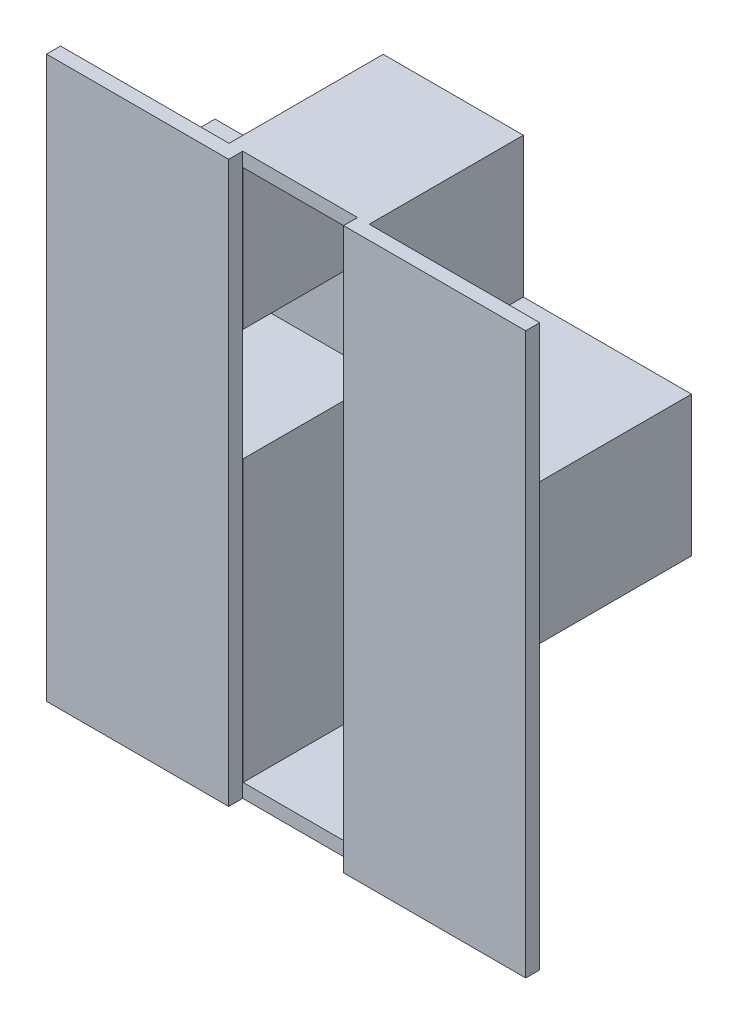
ISO-10303-21;
HEADER;
FILE_DESCRIPTION(('STEP AP214'),'2;1');
FILE_NAME('part.step','',(''),(''),'','','');
FILE_SCHEMA(('AUTOMOTIVE_DESIGN { 1 0 10303 214 1 1 1 1 }'));
ENDSEC;
DATA;
#1=APPLICATION_CONTEXT('core data for automotive mechanical design processes');
#2=APPLICATION_PROTOCOL_DEFINITION('international standard','automotive_design',2000,#1);
#3=PRODUCT_CONTEXT('',#1,'mechanical');
#4=PRODUCT('Part','Part','',(#3));
#5=PRODUCT_RELATED_PRODUCT_CATEGORY('part','',(#4));
#6=PRODUCT_DEFINITION_FORMATION('','',#4);
#7=PRODUCT_DEFINITION_CONTEXT('part definition',#1,'design');
#8=PRODUCT_DEFINITION('design','',#6,#7);
#9=PRODUCT_DEFINITION_SHAPE('','',#8);
#10=(LENGTH_UNIT() NAMED_UNIT(*) SI_UNIT(.MILLI.,.METRE.));
#11=(NAMED_UNIT(*) PLANE_ANGLE_UNIT() SI_UNIT($,.RADIAN.));
#12=(NAMED_UNIT(*) SI_UNIT($,.STERADIAN.) SOLID_ANGLE_UNIT());
#13=UNCERTAINTY_MEASURE_WITH_UNIT(LENGTH_MEASURE(1.E-05),#10,'distance_accuracy_value','');
#14=(GEOMETRIC_REPRESENTATION_CONTEXT(3) GLOBAL_UNCERTAINTY_ASSIGNED_CONTEXT((#13)) GLOBAL_UNIT_ASSIGNED_CONTEXT((#10,
#11,#12)) REPRESENTATION_CONTEXT('',''));
#15=CARTESIAN_POINT('',(0.,0.,0.));
#16=DIRECTION('',(0.,0.,1.));
#17=DIRECTION('',(1.,0.,0.));
#18=AXIS2_PLACEMENT_3D('',#15,#16,#17);
#19=CARTESIAN_POINT('',(0.,0.,55.));
#20=DIRECTION('',(0.,0.,-1.));
#21=DIRECTION('',(-1.,0.,0.));
#22=AXIS2_PLACEMENT_3D('',#19,#20,#21);
#23=PLANE('',#22);
#24=DIRECTION('',(0.,-1.,0.));
#25=VECTOR('',#24,1.);
#26=CARTESIAN_POINT('',(-4.14911528752093,200.,55.));
#27=LINE('',#26,#25);
#28=CARTESIAN_POINT('',(-4.14911528752093,200.,55.));
#29=VERTEX_POINT('',#28);
#30=CARTESIAN_POINT('',(-4.14911528752093,145.,55.));
#31=VERTEX_POINT('',#30);
#32=EDGE_CURVE('E51',#29,#31,#27,.T.);
#33=ORIENTED_EDGE('',*,*,#32,.F.);
#34=DIRECTION('',(-1.,0.,0.));
#35=VECTOR('',#34,1.);
#36=CARTESIAN_POINT('',(0.,200.,55.));
#37=LINE('',#36,#35);
#38=CARTESIAN_POINT('',(-45.1360003244453,200.,55.));
#39=VERTEX_POINT('',#38);
#40=EDGE_CURVE('E37',#29,#39,#37,.T.);
#41=ORIENTED_EDGE('',*,*,#40,.T.);
#42=DIRECTION('',(0.,1.,0.));
#43=VECTOR('',#42,1.);
#44=CARTESIAN_POINT('',(-45.1360003244453,0.,55.));
#45=LINE('',#44,#43);
#46=CARTESIAN_POINT('',(-45.1360003244453,145.,55.));
#47=VERTEX_POINT('',#46);
#48=EDGE_CURVE('E11',#47,#39,#45,.T.);
#49=ORIENTED_EDGE('',*,*,#48,.F.);
#50=DIRECTION('',(-1.,0.,0.));
#51=VECTOR('',#50,1.);
#52=CARTESIAN_POINT('',(-45.,145.,55.));
#53=LINE('',#52,#51);
#54=CARTESIAN_POINT('',(-45.,145.,55.));
#55=VERTEX_POINT('',#54);
#56=EDGE_CURVE('E314',#55,#47,#53,.T.);
#57=ORIENTED_EDGE('',*,*,#56,.F.);
#58=DIRECTION('',(0.,-1.,0.));
#59=VECTOR('',#58,1.);
#60=CARTESIAN_POINT('',(-45.,195.,55.));
#61=LINE('',#60,#59);
#62=CARTESIAN_POINT('',(-45.,195.,55.));
#63=VERTEX_POINT('',#62);
#64=EDGE_CURVE('E922',#63,#55,#61,.T.);
#65=ORIENTED_EDGE('',*,*,#64,.F.);
#66=DIRECTION('',(-1.,0.,0.));
#67=VECTOR('',#66,1.);
#68=CARTESIAN_POINT('',(-4.99999999999997,195.,55.));
#69=LINE('',#68,#67);
#70=CARTESIAN_POINT('',(-4.99999999999997,195.,55.));
#71=VERTEX_POINT('',#70);
#72=EDGE_CURVE('E919',#71,#63,#69,.T.);
#73=ORIENTED_EDGE('',*,*,#72,.F.);
#74=DIRECTION('',(0.,1.,0.));
#75=VECTOR('',#74,1.);
#76=CARTESIAN_POINT('',(-4.99999999999997,145.,55.));
#77=LINE('',#76,#75);
#78=CARTESIAN_POINT('',(-4.99999999999997,145.,55.));
#79=VERTEX_POINT('',#78);
#80=EDGE_CURVE('E917',#79,#71,#77,.T.);
#81=ORIENTED_EDGE('',*,*,#80,.F.);
#82=DIRECTION('',(-1.,0.,0.));
#83=VECTOR('',#82,1.);
#84=CARTESIAN_POINT('',(55.,145.,55.));
#85=LINE('',#84,#83);
#86=EDGE_CURVE('E908',#31,#79,#85,.T.);
#87=ORIENTED_EDGE('',*,*,#86,.F.);
#88=EDGE_LOOP('',(#33,#41,#49,#57,#65,#73,#81,#87));
#89=FACE_BOUND('',#88,.T.);
#90=ADVANCED_FACE('F33',(#89),#23,.F.);
#91=CARTESIAN_POINT('',(-4.14911528752092,105.,55.));
#92=VERTEX_POINT('',#91);
#93=CARTESIAN_POINT('',(-4.1491152875209,0.,55.));
#94=VERTEX_POINT('',#93);
#95=EDGE_CURVE('E281',#92,#94,#27,.T.);
#96=ORIENTED_EDGE('',*,*,#95,.F.);
#97=DIRECTION('',(1.,0.,0.));
#98=VECTOR('',#97,1.);
#99=CARTESIAN_POINT('',(-5.,105.,55.));
#100=LINE('',#99,#98);
#101=CARTESIAN_POINT('',(-5.,105.,55.));
#102=VERTEX_POINT('',#101);
#103=EDGE_CURVE('E901',#102,#92,#100,.T.);
#104=ORIENTED_EDGE('',*,*,#103,.F.);
#105=DIRECTION('',(0.,1.,0.));
#106=VECTOR('',#105,1.);
#107=CARTESIAN_POINT('',(-5.,4.99999999999999,55.));
#108=LINE('',#107,#106);
#109=CARTESIAN_POINT('',(-5.,4.99999999999999,55.));
#110=VERTEX_POINT('',#109);
#111=EDGE_CURVE('E906',#110,#102,#108,.T.);
#112=ORIENTED_EDGE('',*,*,#111,.F.);
#113=DIRECTION('',(1.,0.,0.));
#114=VECTOR('',#113,1.);
#115=CARTESIAN_POINT('',(-45.,4.99999999999999,55.));
#116=LINE('',#115,#114);
#117=CARTESIAN_POINT('',(-45.,4.99999999999999,55.));
#118=VERTEX_POINT('',#117);
#119=EDGE_CURVE('E910',#118,#110,#116,.T.);
#120=ORIENTED_EDGE('',*,*,#119,.F.);
#121=DIRECTION('',(0.,-1.,0.));
#122=VECTOR('',#121,1.);
#123=CARTESIAN_POINT('',(-45.,105.,55.));
#124=LINE('',#123,#122);
#125=CARTESIAN_POINT('',(-45.,105.,55.));
#126=VERTEX_POINT('',#125);
#127=EDGE_CURVE('E985',#126,#118,#124,.T.);
#128=ORIENTED_EDGE('',*,*,#127,.F.);
#129=DIRECTION('',(1.,0.,0.));
#130=VECTOR('',#129,1.);
#131=CARTESIAN_POINT('',(-105.,105.,55.));
#132=LINE('',#131,#130);
#133=CARTESIAN_POINT('',(-45.1360003244453,105.,55.));
#134=VERTEX_POINT('',#133);
#135=EDGE_CURVE('E59',#134,#126,#132,.T.);
#136=ORIENTED_EDGE('',*,*,#135,.F.);
#137=CARTESIAN_POINT('',(-45.1360003244453,0.,55.));
#138=VERTEX_POINT('',#137);
#139=EDGE_CURVE('E295',#138,#134,#45,.T.);
#140=ORIENTED_EDGE('',*,*,#139,.F.);
#141=DIRECTION('',(1.,0.,0.));
#142=VECTOR('',#141,1.);
#143=CARTESIAN_POINT('',(-50.,0.,55.));
#144=LINE('',#143,#142);
#145=EDGE_CURVE('E347',#138,#94,#144,.T.);
#146=ORIENTED_EDGE('',*,*,#145,.T.);
#147=EDGE_LOOP('',(#96,#104,#112,#120,#128,#136,#140,#146));
#148=FACE_BOUND('',#147,.T.);
#149=ADVANCED_FACE('F514',(#148),#23,.F.);
#150=CARTESIAN_POINT('',(0.,0.,5.));
#151=DIRECTION('',(-1.,0.,0.));
#152=DIRECTION('',(0.,0.,1.));
#153=AXIS2_PLACEMENT_3D('',#150,#151,#152);
#154=PLANE('',#153);
#155=DIRECTION('',(0.,1.,0.));
#156=VECTOR('',#155,1.);
#157=CARTESIAN_POINT('',(0.,0.,0.));
#158=LINE('',#157,#156);
#159=CARTESIAN_POINT('',(0.,0.,0.));
#160=VERTEX_POINT('',#159);
#161=CARTESIAN_POINT('',(0.,100.,0.));
#162=VERTEX_POINT('',#161);
#163=EDGE_CURVE('E409',#160,#162,#158,.T.);
#164=ORIENTED_EDGE('',*,*,#163,.T.);
#165=DIRECTION('',(0.,0.,-1.));
#166=VECTOR('',#165,1.);
#167=CARTESIAN_POINT('',(0.,100.,5.));
#168=LINE('',#167,#166);
#169=CARTESIAN_POINT('',(0.,100.,55.));
#170=VERTEX_POINT('',#169);
#171=EDGE_CURVE('E43',#170,#162,#168,.T.);
#172=ORIENTED_EDGE('',*,*,#171,.F.);
#173=DIRECTION('',(0.,1.,0.));
#174=VECTOR('',#173,1.);
#175=CARTESIAN_POINT('',(0.,0.,55.));
#176=LINE('',#175,#174);
#177=CARTESIAN_POINT('',(0.,0.,55.));
#178=VERTEX_POINT('',#177);
#179=EDGE_CURVE('E357',#178,#170,#176,.T.);
#180=ORIENTED_EDGE('',*,*,#179,.F.);
#181=DIRECTION('',(0.,0.,-1.));
#182=VECTOR('',#181,1.);
#183=CARTESIAN_POINT('',(0.,0.,5.));
#184=LINE('',#183,#182);
#185=EDGE_CURVE('E340',#178,#160,#184,.T.);
#186=ORIENTED_EDGE('',*,*,#185,.T.);
#187=EDGE_LOOP('',(#164,#172,#180,#186));
#188=FACE_BOUND('',#187,.T.);
#189=ADVANCED_FACE('F35',(#188),#154,.F.);
#190=CARTESIAN_POINT('',(60.,100.,5.));
#191=DIRECTION('',(0.,1.,0.));
#192=DIRECTION('',(-1.,0.,0.));
#193=AXIS2_PLACEMENT_3D('',#190,#191,#192);
#194=PLANE('',#193);
#195=DIRECTION('',(1.,0.,0.));
#196=VECTOR('',#195,1.);
#197=CARTESIAN_POINT('',(60.,100.,0.));
#198=LINE('',#197,#196);
#199=CARTESIAN_POINT('',(60.,100.,0.));
#200=VERTEX_POINT('',#199);
#201=EDGE_CURVE('E407',#162,#200,#198,.T.);
#202=ORIENTED_EDGE('',*,*,#201,.T.);
#203=DIRECTION('',(0.,0.,-1.));
#204=VECTOR('',#203,1.);
#205=CARTESIAN_POINT('',(60.,100.,5.));
#206=LINE('',#205,#204);
#207=CARTESIAN_POINT('',(60.,100.,55.));
#208=VERTEX_POINT('',#207);
#209=EDGE_CURVE('E362',#208,#200,#206,.T.);
#210=ORIENTED_EDGE('',*,*,#209,.F.);
#211=DIRECTION('',(1.,0.,0.));
#212=VECTOR('',#211,1.);
#213=CARTESIAN_POINT('',(0.,100.,55.));
#214=LINE('',#213,#212);
#215=EDGE_CURVE('E418',#170,#208,#214,.T.);
#216=ORIENTED_EDGE('',*,*,#215,.F.);
#217=ORIENTED_EDGE('',*,*,#171,.T.);
#218=EDGE_LOOP('',(#202,#210,#216,#217));
#219=FACE_BOUND('',#218,.T.);
#220=ADVANCED_FACE('F431',(#219),#194,.F.);
#221=CARTESIAN_POINT('',(60.,100.,5.));
#222=DIRECTION('',(-1.,0.,0.));
#223=DIRECTION('',(0.,-1.,0.));
#224=AXIS2_PLACEMENT_3D('',#221,#222,#223);
#225=PLANE('',#224);
#226=DIRECTION('',(0.,1.,0.));
#227=VECTOR('',#226,1.);
#228=CARTESIAN_POINT('',(60.,100.,0.));
#229=LINE('',#228,#227);
#230=CARTESIAN_POINT('',(60.,150.,0.));
#231=VERTEX_POINT('',#230);
#232=EDGE_CURVE('E405',#200,#231,#229,.T.);
#233=ORIENTED_EDGE('',*,*,#232,.T.);
#234=DIRECTION('',(0.,0.,-1.));
#235=VECTOR('',#234,1.);
#236=CARTESIAN_POINT('',(60.,150.,5.));
#237=LINE('',#236,#235);
#238=CARTESIAN_POINT('',(60.,150.,55.));
#239=VERTEX_POINT('',#238);
#240=EDGE_CURVE('E365',#239,#231,#237,.T.);
#241=ORIENTED_EDGE('',*,*,#240,.F.);
#242=DIRECTION('',(0.,1.,0.));
#243=VECTOR('',#242,1.);
#244=CARTESIAN_POINT('',(60.,100.,55.));
#245=LINE('',#244,#243);
#246=EDGE_CURVE('E417',#208,#239,#245,.T.);
#247=ORIENTED_EDGE('',*,*,#246,.F.);
#248=ORIENTED_EDGE('',*,*,#209,.T.);
#249=EDGE_LOOP('',(#233,#241,#247,#248));
#250=FACE_BOUND('',#249,.T.);
#251=ADVANCED_FACE('F436',(#250),#225,.F.);
#252=CARTESIAN_POINT('',(60.,150.,5.));
#253=DIRECTION('',(0.,-1.,0.));
#254=DIRECTION('',(0.,0.,-1.));
#255=AXIS2_PLACEMENT_3D('',#252,#253,#254);
#256=PLANE('',#255);
#257=DIRECTION('',(-1.,0.,0.));
#258=VECTOR('',#257,1.);
#259=CARTESIAN_POINT('',(60.,150.,0.));
#260=LINE('',#259,#258);
#261=CARTESIAN_POINT('',(0.,150.,0.));
#262=VERTEX_POINT('',#261);
#263=EDGE_CURVE('E403',#231,#262,#260,.T.);
#264=ORIENTED_EDGE('',*,*,#263,.T.);
#265=DIRECTION('',(0.,0.,-1.));
#266=VECTOR('',#265,1.);
#267=CARTESIAN_POINT('',(0.,150.,5.));
#268=LINE('',#267,#266);
#269=CARTESIAN_POINT('',(0.,150.,55.));
#270=VERTEX_POINT('',#269);
#271=EDGE_CURVE('E368',#270,#262,#268,.T.);
#272=ORIENTED_EDGE('',*,*,#271,.F.);
#273=DIRECTION('',(-1.,0.,0.));
#274=VECTOR('',#273,1.);
#275=CARTESIAN_POINT('',(60.,150.,55.));
#276=LINE('',#275,#274);
#277=EDGE_CURVE('E415',#239,#270,#276,.T.);
#278=ORIENTED_EDGE('',*,*,#277,.F.);
#279=ORIENTED_EDGE('',*,*,#240,.T.);
#280=EDGE_LOOP('',(#264,#272,#278,#279));
#281=FACE_BOUND('',#280,.T.);
#282=ADVANCED_FACE('F443',(#281),#256,.F.);
#283=CARTESIAN_POINT('',(0.,150.,5.));
#284=DIRECTION('',(-1.,0.,0.));
#285=DIRECTION('',(0.,-1.,0.));
#286=AXIS2_PLACEMENT_3D('',#283,#284,#285);
#287=PLANE('',#286);
#288=DIRECTION('',(0.,1.,0.));
#289=VECTOR('',#288,1.);
#290=CARTESIAN_POINT('',(0.,150.,0.));
#291=LINE('',#290,#289);
#292=CARTESIAN_POINT('',(0.,200.,0.));
#293=VERTEX_POINT('',#292);
#294=EDGE_CURVE('E401',#262,#293,#291,.T.);
#295=ORIENTED_EDGE('',*,*,#294,.T.);
#296=DIRECTION('',(0.,0.,-1.));
#297=VECTOR('',#296,1.);
#298=CARTESIAN_POINT('',(0.,200.,5.));
#299=LINE('',#298,#297);
#300=CARTESIAN_POINT('',(0.,200.,55.));
#301=VERTEX_POINT('',#300);
#302=EDGE_CURVE('E371',#301,#293,#299,.T.);
#303=ORIENTED_EDGE('',*,*,#302,.F.);
#304=DIRECTION('',(0.,1.,0.));
#305=VECTOR('',#304,1.);
#306=CARTESIAN_POINT('',(0.,150.,55.));
#307=LINE('',#306,#305);
#308=EDGE_CURVE('E413',#270,#301,#307,.T.);
#309=ORIENTED_EDGE('',*,*,#308,.F.);
#310=ORIENTED_EDGE('',*,*,#271,.T.);
#311=EDGE_LOOP('',(#295,#303,#309,#310));
#312=FACE_BOUND('',#311,.T.);
#313=ADVANCED_FACE('F448',(#312),#287,.F.);
#314=CARTESIAN_POINT('',(-50.,200.,5.));
#315=DIRECTION('',(0.,-1.,0.));
#316=DIRECTION('',(0.,0.,-1.));
#317=AXIS2_PLACEMENT_3D('',#314,#315,#316);
#318=PLANE('',#317);
#319=DIRECTION('',(-1.,0.,0.));
#320=VECTOR('',#319,1.);
#321=CARTESIAN_POINT('',(-50.,200.,0.));
#322=LINE('',#321,#320);
#323=CARTESIAN_POINT('',(-50.,200.,0.));
#324=VERTEX_POINT('',#323);
#325=EDGE_CURVE('E399',#293,#324,#322,.T.);
#326=ORIENTED_EDGE('',*,*,#325,.T.);
#327=DIRECTION('',(0.,0.,-1.));
#328=VECTOR('',#327,1.);
#329=CARTESIAN_POINT('',(-50.,200.,5.));
#330=LINE('',#329,#328);
#331=CARTESIAN_POINT('',(-50.,200.,55.));
#332=VERTEX_POINT('',#331);
#333=EDGE_CURVE('E349',#332,#324,#330,.T.);
#334=ORIENTED_EDGE('',*,*,#333,.F.);
#335=DIRECTION('',(-1.,0.,0.));
#336=VECTOR('',#335,1.);
#337=CARTESIAN_POINT('',(-45.1360003244453,200.,55.));
#338=LINE('',#337,#336);
#339=CARTESIAN_POINT('',(-110.136000324445,200.,55.));
#340=VERTEX_POINT('',#339);
#341=EDGE_CURVE('E311',#332,#340,#338,.T.);
#342=ORIENTED_EDGE('',*,*,#341,.T.);
#343=DIRECTION('',(0.,0.,-1.));
#344=VECTOR('',#343,1.);
#345=CARTESIAN_POINT('',(-110.136000324445,200.,60.));
#346=LINE('',#345,#344);
#347=CARTESIAN_POINT('',(-110.136000324445,200.,60.));
#348=VERTEX_POINT('',#347);
#349=EDGE_CURVE('E320',#348,#340,#346,.T.);
#350=ORIENTED_EDGE('',*,*,#349,.F.);
#351=DIRECTION('',(-1.,0.,0.));
#352=VECTOR('',#351,1.);
#353=CARTESIAN_POINT('',(-45.1360003244453,200.,60.));
#354=LINE('',#353,#352);
#355=CARTESIAN_POINT('',(-45.1360003244453,200.,60.));
#356=VERTEX_POINT('',#355);
#357=EDGE_CURVE('E298',#356,#348,#354,.T.);
#358=ORIENTED_EDGE('',*,*,#357,.F.);
#359=DIRECTION('',(0.,0.,-1.));
#360=VECTOR('',#359,1.);
#361=CARTESIAN_POINT('',(-45.1360003244453,200.,60.));
#362=LINE('',#361,#360);
#363=EDGE_CURVE('E333',#356,#39,#362,.T.);
#364=ORIENTED_EDGE('',*,*,#363,.T.);
#365=ORIENTED_EDGE('',*,*,#40,.F.);
#366=DIRECTION('',(0.,0.,-1.));
#367=VECTOR('',#366,1.);
#368=CARTESIAN_POINT('',(-4.14911528752093,200.,60.));
#369=LINE('',#368,#367);
#370=CARTESIAN_POINT('',(-4.14911528752093,200.,60.));
#371=VERTEX_POINT('',#370);
#372=EDGE_CURVE('E1015',#371,#29,#369,.T.);
#373=ORIENTED_EDGE('',*,*,#372,.F.);
#374=DIRECTION('',(-1.,0.,0.));
#375=VECTOR('',#374,1.);
#376=CARTESIAN_POINT('',(-4.14911528752093,200.,60.));
#377=LINE('',#376,#375);
#378=CARTESIAN_POINT('',(60.8508847124791,200.,60.));
#379=VERTEX_POINT('',#378);
#380=EDGE_CURVE('E275',#379,#371,#377,.T.);
#381=ORIENTED_EDGE('',*,*,#380,.F.);
#382=DIRECTION('',(0.,0.,-1.));
#383=VECTOR('',#382,1.);
#384=CARTESIAN_POINT('',(60.8508847124791,200.,60.));
#385=LINE('',#384,#383);
#386=CARTESIAN_POINT('',(60.8508847124791,200.,55.));
#387=VERTEX_POINT('',#386);
#388=EDGE_CURVE('E287',#379,#387,#385,.T.);
#389=ORIENTED_EDGE('',*,*,#388,.T.);
#390=DIRECTION('',(-1.,0.,0.));
#391=VECTOR('',#390,1.);
#392=CARTESIAN_POINT('',(-4.14911528752093,200.,55.));
#393=LINE('',#392,#391);
#394=EDGE_CURVE('E277',#387,#301,#393,.T.);
#395=ORIENTED_EDGE('',*,*,#394,.T.);
#396=ORIENTED_EDGE('',*,*,#302,.T.);
#397=EDGE_LOOP('',(#326,#334,#342,#350,#358,#364,#365,#373,#381,#389,#395,#396));
#398=FACE_BOUND('',#397,.T.);
#399=ADVANCED_FACE('F451',(#398),#318,.F.);
#400=CARTESIAN_POINT('',(-50.,150.,5.));
#401=DIRECTION('',(1.,0.,0.));
#402=DIRECTION('',(0.,0.,-1.));
#403=AXIS2_PLACEMENT_3D('',#400,#401,#402);
#404=PLANE('',#403);
#405=DIRECTION('',(0.,-1.,0.));
#406=VECTOR('',#405,1.);
#407=CARTESIAN_POINT('',(-50.,150.,0.));
#408=LINE('',#407,#406);
#409=CARTESIAN_POINT('',(-50.,150.,0.));
#410=VERTEX_POINT('',#409);
#411=EDGE_CURVE('E397',#324,#410,#408,.T.);
#412=ORIENTED_EDGE('',*,*,#411,.T.);
#413=DIRECTION('',(0.,0.,-1.));
#414=VECTOR('',#413,1.);
#415=CARTESIAN_POINT('',(-50.,150.,5.));
#416=LINE('',#415,#414);
#417=CARTESIAN_POINT('',(-50.,150.,55.));
#418=VERTEX_POINT('',#417);
#419=EDGE_CURVE('E374',#418,#410,#416,.T.);
#420=ORIENTED_EDGE('',*,*,#419,.F.);
#421=DIRECTION('',(0.,-1.,0.));
#422=VECTOR('',#421,1.);
#423=CARTESIAN_POINT('',(-50.,200.,55.));
#424=LINE('',#423,#422);
#425=EDGE_CURVE('E472',#332,#418,#424,.T.);
#426=ORIENTED_EDGE('',*,*,#425,.F.);
#427=ORIENTED_EDGE('',*,*,#333,.T.);
#428=EDGE_LOOP('',(#412,#420,#426,#427));
#429=FACE_BOUND('',#428,.T.);
#430=ADVANCED_FACE('F460',(#429),#404,.F.);
#431=CARTESIAN_POINT('',(-50.,150.,5.));
#432=DIRECTION('',(0.,-1.,0.));
#433=DIRECTION('',(1.,0.,0.));
#434=AXIS2_PLACEMENT_3D('',#431,#432,#433);
#435=PLANE('',#434);
#436=DIRECTION('',(-1.,0.,0.));
#437=VECTOR('',#436,1.);
#438=CARTESIAN_POINT('',(-50.,150.,0.));
#439=LINE('',#438,#437);
#440=CARTESIAN_POINT('',(-110.,150.,0.));
#441=VERTEX_POINT('',#440);
#442=EDGE_CURVE('E395',#410,#441,#439,.T.);
#443=ORIENTED_EDGE('',*,*,#442,.T.);
#444=DIRECTION('',(0.,0.,-1.));
#445=VECTOR('',#444,1.);
#446=CARTESIAN_POINT('',(-110.,150.,5.));
#447=LINE('',#446,#445);
#448=CARTESIAN_POINT('',(-110.,150.,55.));
#449=VERTEX_POINT('',#448);
#450=EDGE_CURVE('E377',#449,#441,#447,.T.);
#451=ORIENTED_EDGE('',*,*,#450,.F.);
#452=DIRECTION('',(-1.,0.,0.));
#453=VECTOR('',#452,1.);
#454=CARTESIAN_POINT('',(-50.,150.,55.));
#455=LINE('',#454,#453);
#456=EDGE_CURVE('E466',#418,#449,#455,.T.);
#457=ORIENTED_EDGE('',*,*,#456,.F.);
#458=ORIENTED_EDGE('',*,*,#419,.T.);
#459=EDGE_LOOP('',(#443,#451,#457,#458));
#460=FACE_BOUND('',#459,.T.);
#461=ADVANCED_FACE('F464',(#460),#435,.F.);
#462=CARTESIAN_POINT('',(-110.,100.,5.));
#463=DIRECTION('',(1.,0.,0.));
#464=DIRECTION('',(0.,0.,-1.));
#465=AXIS2_PLACEMENT_3D('',#462,#463,#464);
#466=PLANE('',#465);
#467=DIRECTION('',(0.,-1.,0.));
#468=VECTOR('',#467,1.);
#469=CARTESIAN_POINT('',(-110.,100.,0.));
#470=LINE('',#469,#468);
#471=CARTESIAN_POINT('',(-110.,100.,0.));
#472=VERTEX_POINT('',#471);
#473=EDGE_CURVE('E393',#441,#472,#470,.T.);
#474=ORIENTED_EDGE('',*,*,#473,.T.);
#475=DIRECTION('',(0.,0.,-1.));
#476=VECTOR('',#475,1.);
#477=CARTESIAN_POINT('',(-110.,100.,5.));
#478=LINE('',#477,#476);
#479=CARTESIAN_POINT('',(-110.,100.,55.));
#480=VERTEX_POINT('',#479);
#481=EDGE_CURVE('E380',#480,#472,#478,.T.);
#482=ORIENTED_EDGE('',*,*,#481,.F.);
#483=DIRECTION('',(0.,-1.,0.));
#484=VECTOR('',#483,1.);
#485=CARTESIAN_POINT('',(-110.,150.,55.));
#486=LINE('',#485,#484);
#487=EDGE_CURVE('E471',#449,#480,#486,.T.);
#488=ORIENTED_EDGE('',*,*,#487,.F.);
#489=ORIENTED_EDGE('',*,*,#450,.T.);
#490=EDGE_LOOP('',(#474,#482,#488,#489));
#491=FACE_BOUND('',#490,.T.);
#492=ADVANCED_FACE('F504',(#491),#466,.F.);
#493=CARTESIAN_POINT('',(-50.,100.,5.));
#494=DIRECTION('',(0.,1.,0.));
#495=DIRECTION('',(-1.,0.,0.));
#496=AXIS2_PLACEMENT_3D('',#493,#494,#495);
#497=PLANE('',#496);
#498=DIRECTION('',(1.,0.,0.));
#499=VECTOR('',#498,1.);
#500=CARTESIAN_POINT('',(-50.,100.,0.));
#501=LINE('',#500,#499);
#502=CARTESIAN_POINT('',(-50.,100.,0.));
#503=VERTEX_POINT('',#502);
#504=EDGE_CURVE('E391',#472,#503,#501,.T.);
#505=ORIENTED_EDGE('',*,*,#504,.T.);
#506=DIRECTION('',(0.,0.,-1.));
#507=VECTOR('',#506,1.);
#508=CARTESIAN_POINT('',(-50.,100.,5.));
#509=LINE('',#508,#507);
#510=CARTESIAN_POINT('',(-50.,100.,55.));
#511=VERTEX_POINT('',#510);
#512=EDGE_CURVE('E339',#511,#503,#509,.T.);
#513=ORIENTED_EDGE('',*,*,#512,.F.);
#514=DIRECTION('',(1.,0.,0.));
#515=VECTOR('',#514,1.);
#516=CARTESIAN_POINT('',(-110.,100.,55.));
#517=LINE('',#516,#515);
#518=EDGE_CURVE('E348',#480,#511,#517,.T.);
#519=ORIENTED_EDGE('',*,*,#518,.F.);
#520=ORIENTED_EDGE('',*,*,#481,.T.);
#521=EDGE_LOOP('',(#505,#513,#519,#520));
#522=FACE_BOUND('',#521,.T.);
#523=ADVANCED_FACE('F496',(#522),#497,.F.);
#524=CARTESIAN_POINT('',(-50.,0.,5.));
#525=DIRECTION('',(1.,0.,0.));
#526=DIRECTION('',(0.,0.,-1.));
#527=AXIS2_PLACEMENT_3D('',#524,#525,#526);
#528=PLANE('',#527);
#529=DIRECTION('',(0.,-1.,0.));
#530=VECTOR('',#529,1.);
#531=CARTESIAN_POINT('',(-50.,0.,0.));
#532=LINE('',#531,#530);
#533=CARTESIAN_POINT('',(-50.,0.,0.));
#534=VERTEX_POINT('',#533);
#535=EDGE_CURVE('E389',#503,#534,#532,.T.);
#536=ORIENTED_EDGE('',*,*,#535,.T.);
#537=DIRECTION('',(0.,0.,-1.));
#538=VECTOR('',#537,1.);
#539=CARTESIAN_POINT('',(-50.,0.,5.));
#540=LINE('',#539,#538);
#541=CARTESIAN_POINT('',(-50.,0.,55.));
#542=VERTEX_POINT('',#541);
#543=EDGE_CURVE('E336',#542,#534,#540,.T.);
#544=ORIENTED_EDGE('',*,*,#543,.F.);
#545=DIRECTION('',(0.,-1.,0.));
#546=VECTOR('',#545,1.);
#547=CARTESIAN_POINT('',(-50.,100.,55.));
#548=LINE('',#547,#546);
#549=EDGE_CURVE('E343',#511,#542,#548,.T.);
#550=ORIENTED_EDGE('',*,*,#549,.F.);
#551=ORIENTED_EDGE('',*,*,#512,.T.);
#552=EDGE_LOOP('',(#536,#544,#550,#551));
#553=FACE_BOUND('',#552,.T.);
#554=ADVANCED_FACE('F500',(#553),#528,.F.);
#555=CARTESIAN_POINT('',(0.,0.,5.));
#556=DIRECTION('',(0.,1.,0.));
#557=DIRECTION('',(-1.,0.,0.));
#558=AXIS2_PLACEMENT_3D('',#555,#556,#557);
#559=PLANE('',#558);
#560=DIRECTION('',(1.,0.,0.));
#561=VECTOR('',#560,1.);
#562=CARTESIAN_POINT('',(0.,0.,0.));
#563=LINE('',#562,#561);
#564=EDGE_CURVE('E387',#534,#160,#563,.T.);
#565=ORIENTED_EDGE('',*,*,#564,.T.);
#566=ORIENTED_EDGE('',*,*,#185,.F.);
#567=DIRECTION('',(1.,0.,0.));
#568=VECTOR('',#567,1.);
#569=CARTESIAN_POINT('',(-4.1491152875209,0.,55.));
#570=LINE('',#569,#568);
#571=CARTESIAN_POINT('',(60.8508847124791,0.,55.));
#572=VERTEX_POINT('',#571);
#573=EDGE_CURVE('E426',#178,#572,#570,.T.);
#574=ORIENTED_EDGE('',*,*,#573,.T.);
#575=DIRECTION('',(0.,0.,-1.));
#576=VECTOR('',#575,1.);
#577=CARTESIAN_POINT('',(60.8508847124791,0.,60.));
#578=LINE('',#577,#576);
#579=CARTESIAN_POINT('',(60.8508847124791,0.,60.));
#580=VERTEX_POINT('',#579);
#581=EDGE_CURVE('E266',#580,#572,#578,.T.);
#582=ORIENTED_EDGE('',*,*,#581,.F.);
#583=DIRECTION('',(1.,0.,0.));
#584=VECTOR('',#583,1.);
#585=CARTESIAN_POINT('',(-4.1491152875209,0.,60.));
#586=LINE('',#585,#584);
#587=CARTESIAN_POINT('',(-4.1491152875209,0.,60.));
#588=VERTEX_POINT('',#587);
#589=EDGE_CURVE('E258',#588,#580,#586,.T.);
#590=ORIENTED_EDGE('',*,*,#589,.F.);
#591=DIRECTION('',(0.,0.,-1.));
#592=VECTOR('',#591,1.);
#593=CARTESIAN_POINT('',(-4.1491152875209,0.,60.));
#594=LINE('',#593,#592);
#595=EDGE_CURVE('E263',#588,#94,#594,.T.);
#596=ORIENTED_EDGE('',*,*,#595,.T.);
#597=ORIENTED_EDGE('',*,*,#145,.F.);
#598=DIRECTION('',(0.,0.,-1.));
#599=VECTOR('',#598,1.);
#600=CARTESIAN_POINT('',(-45.1360003244453,0.,60.));
#601=LINE('',#600,#599);
#602=CARTESIAN_POINT('',(-45.1360003244453,0.,60.));
#603=VERTEX_POINT('',#602);
#604=EDGE_CURVE('E329',#603,#138,#601,.T.);
#605=ORIENTED_EDGE('',*,*,#604,.F.);
#606=DIRECTION('',(-1.,0.,0.));
#607=VECTOR('',#606,1.);
#608=CARTESIAN_POINT('',(-45.1360003244453,0.,60.));
#609=LINE('',#608,#607);
#610=CARTESIAN_POINT('',(-110.136000324445,0.,60.));
#611=VERTEX_POINT('',#610);
#612=EDGE_CURVE('E291',#603,#611,#609,.T.);
#613=ORIENTED_EDGE('',*,*,#612,.T.);
#614=DIRECTION('',(0.,0.,-1.));
#615=VECTOR('',#614,1.);
#616=CARTESIAN_POINT('',(-110.136000324445,0.,60.));
#617=LINE('',#616,#615);
#618=CARTESIAN_POINT('',(-110.136000324445,0.,55.));
#619=VERTEX_POINT('',#618);
#620=EDGE_CURVE('E302',#611,#619,#617,.T.);
#621=ORIENTED_EDGE('',*,*,#620,.T.);
#622=DIRECTION('',(-1.,0.,0.));
#623=VECTOR('',#622,1.);
#624=CARTESIAN_POINT('',(-45.1360003244453,0.,55.));
#625=LINE('',#624,#623);
#626=EDGE_CURVE('E285',#542,#619,#625,.T.);
#627=ORIENTED_EDGE('',*,*,#626,.F.);
#628=ORIENTED_EDGE('',*,*,#543,.T.);
#629=EDGE_LOOP('',(#565,#566,#574,#582,#590,#596,#597,#605,#613,#621,#627,#628));
#630=FACE_BOUND('',#629,.T.);
#631=ADVANCED_FACE('F260',(#630),#559,.F.);
#632=CARTESIAN_POINT('',(0.,0.,0.));
#633=DIRECTION('',(0.,0.,1.));
#634=DIRECTION('',(1.,0.,0.));
#635=AXIS2_PLACEMENT_3D('',#632,#633,#634);
#636=PLANE('',#635);
#637=ORIENTED_EDGE('',*,*,#163,.F.);
#638=ORIENTED_EDGE('',*,*,#564,.F.);
#639=ORIENTED_EDGE('',*,*,#535,.F.);
#640=ORIENTED_EDGE('',*,*,#504,.F.);
#641=ORIENTED_EDGE('',*,*,#473,.F.);
#642=ORIENTED_EDGE('',*,*,#442,.F.);
#643=ORIENTED_EDGE('',*,*,#411,.F.);
#644=ORIENTED_EDGE('',*,*,#325,.F.);
#645=ORIENTED_EDGE('',*,*,#294,.F.);
#646=ORIENTED_EDGE('',*,*,#263,.F.);
#647=ORIENTED_EDGE('',*,*,#232,.F.);
#648=ORIENTED_EDGE('',*,*,#201,.F.);
#649=EDGE_LOOP('',(#637,#638,#639,#640,#641,#642,#643,#644,#645,#646,#647,#648));
#650=FACE_BOUND('',#649,.T.);
#651=ADVANCED_FACE('F456',(#650),#636,.F.);
#652=CARTESIAN_POINT('',(-45.,145.,55.));
#653=DIRECTION('',(0.,-1.,0.));
#654=DIRECTION('',(0.,0.,-1.));
#655=AXIS2_PLACEMENT_3D('',#652,#653,#654);
#656=PLANE('',#655);
#657=DIRECTION('',(-1.,0.,0.));
#658=VECTOR('',#657,1.);
#659=CARTESIAN_POINT('',(-45.,145.,5.));
#660=LINE('',#659,#658);
#661=CARTESIAN_POINT('',(-45.,145.,5.));
#662=VERTEX_POINT('',#661);
#663=CARTESIAN_POINT('',(-105.,145.,5.));
#664=VERTEX_POINT('',#663);
#665=EDGE_CURVE('E332',#662,#664,#660,.T.);
#666=ORIENTED_EDGE('',*,*,#665,.F.);
#667=DIRECTION('',(0.,0.,-1.));
#668=VECTOR('',#667,1.);
#669=CARTESIAN_POINT('',(-45.,145.,55.));
#670=LINE('',#669,#668);
#671=EDGE_CURVE('E924',#55,#662,#670,.T.);
#672=ORIENTED_EDGE('',*,*,#671,.F.);
#673=ORIENTED_EDGE('',*,*,#56,.T.);
#674=CARTESIAN_POINT('',(-105.,145.,55.));
#675=VERTEX_POINT('',#674);
#676=EDGE_CURVE('E948',#47,#675,#53,.T.);
#677=ORIENTED_EDGE('',*,*,#676,.T.);
#678=DIRECTION('',(0.,0.,-1.));
#679=VECTOR('',#678,1.);
#680=CARTESIAN_POINT('',(-105.,145.,55.));
#681=LINE('',#680,#679);
#682=EDGE_CURVE('E477',#675,#664,#681,.T.);
#683=ORIENTED_EDGE('',*,*,#682,.T.);
#684=EDGE_LOOP('',(#666,#672,#673,#677,#683));
#685=FACE_BOUND('',#684,.T.);
#686=ADVANCED_FACE('F522',(#685),#656,.T.);
#687=CARTESIAN_POINT('',(-105.,145.,55.));
#688=DIRECTION('',(1.,0.,0.));
#689=DIRECTION('',(0.,0.,-1.));
#690=AXIS2_PLACEMENT_3D('',#687,#688,#689);
#691=PLANE('',#690);
#692=DIRECTION('',(0.,-1.,0.));
#693=VECTOR('',#692,1.);
#694=CARTESIAN_POINT('',(-105.,145.,5.));
#695=LINE('',#694,#693);
#696=CARTESIAN_POINT('',(-105.,105.,5.));
#697=VERTEX_POINT('',#696);
#698=EDGE_CURVE('E926',#664,#697,#695,.T.);
#699=ORIENTED_EDGE('',*,*,#698,.F.);
#700=ORIENTED_EDGE('',*,*,#682,.F.);
#701=DIRECTION('',(0.,-1.,0.));
#702=VECTOR('',#701,1.);
#703=CARTESIAN_POINT('',(-105.,145.,55.));
#704=LINE('',#703,#702);
#705=CARTESIAN_POINT('',(-105.,105.,55.));
#706=VERTEX_POINT('',#705);
#707=EDGE_CURVE('E980',#675,#706,#704,.T.);
#708=ORIENTED_EDGE('',*,*,#707,.T.);
#709=DIRECTION('',(0.,0.,-1.));
#710=VECTOR('',#709,1.);
#711=CARTESIAN_POINT('',(-105.,105.,55.));
#712=LINE('',#711,#710);
#713=EDGE_CURVE('E480',#706,#697,#712,.T.);
#714=ORIENTED_EDGE('',*,*,#713,.T.);
#715=EDGE_LOOP('',(#699,#700,#708,#714));
#716=FACE_BOUND('',#715,.T.);
#717=ADVANCED_FACE('F556',(#716),#691,.T.);
#718=CARTESIAN_POINT('',(-105.,105.,55.));
#719=DIRECTION('',(0.,1.,0.));
#720=DIRECTION('',(0.,0.,1.));
#721=AXIS2_PLACEMENT_3D('',#718,#719,#720);
#722=PLANE('',#721);
#723=DIRECTION('',(1.,0.,0.));
#724=VECTOR('',#723,1.);
#725=CARTESIAN_POINT('',(-105.,105.,5.));
#726=LINE('',#725,#724);
#727=CARTESIAN_POINT('',(-45.,105.,5.));
#728=VERTEX_POINT('',#727);
#729=EDGE_CURVE('E928',#697,#728,#726,.T.);
#730=ORIENTED_EDGE('',*,*,#729,.F.);
#731=ORIENTED_EDGE('',*,*,#713,.F.);
#732=EDGE_CURVE('E982',#706,#134,#132,.T.);
#733=ORIENTED_EDGE('',*,*,#732,.T.);
#734=ORIENTED_EDGE('',*,*,#135,.T.);
#735=DIRECTION('',(0.,0.,-1.));
#736=VECTOR('',#735,1.);
#737=CARTESIAN_POINT('',(-45.,105.,55.));
#738=LINE('',#737,#736);
#739=EDGE_CURVE('E488',#126,#728,#738,.T.);
#740=ORIENTED_EDGE('',*,*,#739,.T.);
#741=EDGE_LOOP('',(#730,#731,#733,#734,#740));
#742=FACE_BOUND('',#741,.T.);
#743=ADVANCED_FACE('F562',(#742),#722,.T.);
#744=CARTESIAN_POINT('',(-45.,105.,55.));
#745=DIRECTION('',(1.,0.,0.));
#746=DIRECTION('',(0.,0.,-1.));
#747=AXIS2_PLACEMENT_3D('',#744,#745,#746);
#748=PLANE('',#747);
#749=DIRECTION('',(0.,-1.,0.));
#750=VECTOR('',#749,1.);
#751=CARTESIAN_POINT('',(-45.,105.,5.));
#752=LINE('',#751,#750);
#753=CARTESIAN_POINT('',(-45.,4.99999999999999,5.));
#754=VERTEX_POINT('',#753);
#755=EDGE_CURVE('E930',#728,#754,#752,.T.);
#756=ORIENTED_EDGE('',*,*,#755,.F.);
#757=ORIENTED_EDGE('',*,*,#739,.F.);
#758=ORIENTED_EDGE('',*,*,#127,.T.);
#759=DIRECTION('',(0.,0.,-1.));
#760=VECTOR('',#759,1.);
#761=CARTESIAN_POINT('',(-45.,4.99999999999999,55.));
#762=LINE('',#761,#760);
#763=EDGE_CURVE('E969',#118,#754,#762,.T.);
#764=ORIENTED_EDGE('',*,*,#763,.T.);
#765=EDGE_LOOP('',(#756,#757,#758,#764));
#766=FACE_BOUND('',#765,.T.);
#767=ADVANCED_FACE('F569',(#766),#748,.T.);
#768=CARTESIAN_POINT('',(-45.,4.99999999999999,55.));
#769=DIRECTION('',(0.,1.,0.));
#770=DIRECTION('',(0.,0.,1.));
#771=AXIS2_PLACEMENT_3D('',#768,#769,#770);
#772=PLANE('',#771);
#773=DIRECTION('',(1.,0.,0.));
#774=VECTOR('',#773,1.);
#775=CARTESIAN_POINT('',(-45.,4.99999999999999,5.));
#776=LINE('',#775,#774);
#777=CARTESIAN_POINT('',(-5.,4.99999999999999,5.));
#778=VERTEX_POINT('',#777);
#779=EDGE_CURVE('E932',#754,#778,#776,.T.);
#780=ORIENTED_EDGE('',*,*,#779,.F.);
#781=ORIENTED_EDGE('',*,*,#763,.F.);
#782=ORIENTED_EDGE('',*,*,#119,.T.);
#783=DIRECTION('',(0.,0.,-1.));
#784=VECTOR('',#783,1.);
#785=CARTESIAN_POINT('',(-5.,4.99999999999999,55.));
#786=LINE('',#785,#784);
#787=EDGE_CURVE('E966',#110,#778,#786,.T.);
#788=ORIENTED_EDGE('',*,*,#787,.T.);
#789=EDGE_LOOP('',(#780,#781,#782,#788));
#790=FACE_BOUND('',#789,.T.);
#791=ADVANCED_FACE('F577',(#790),#772,.T.);
#792=CARTESIAN_POINT('',(-5.,4.99999999999999,55.));
#793=DIRECTION('',(-1.,0.,0.));
#794=DIRECTION('',(0.,0.,1.));
#795=AXIS2_PLACEMENT_3D('',#792,#793,#794);
#796=PLANE('',#795);
#797=DIRECTION('',(0.,1.,0.));
#798=VECTOR('',#797,1.);
#799=CARTESIAN_POINT('',(-5.,4.99999999999999,5.));
#800=LINE('',#799,#798);
#801=CARTESIAN_POINT('',(-5.,105.,5.));
#802=VERTEX_POINT('',#801);
#803=EDGE_CURVE('E934',#778,#802,#800,.T.);
#804=ORIENTED_EDGE('',*,*,#803,.F.);
#805=ORIENTED_EDGE('',*,*,#787,.F.);
#806=ORIENTED_EDGE('',*,*,#111,.T.);
#807=DIRECTION('',(0.,0.,-1.));
#808=VECTOR('',#807,1.);
#809=CARTESIAN_POINT('',(-5.,105.,55.));
#810=LINE('',#809,#808);
#811=EDGE_CURVE('E905',#102,#802,#810,.T.);
#812=ORIENTED_EDGE('',*,*,#811,.T.);
#813=EDGE_LOOP('',(#804,#805,#806,#812));
#814=FACE_BOUND('',#813,.T.);
#815=ADVANCED_FACE('F585',(#814),#796,.T.);
#816=CARTESIAN_POINT('',(-5.,105.,55.));
#817=DIRECTION('',(0.,1.,0.));
#818=DIRECTION('',(0.,0.,1.));
#819=AXIS2_PLACEMENT_3D('',#816,#817,#818);
#820=PLANE('',#819);
#821=DIRECTION('',(1.,0.,0.));
#822=VECTOR('',#821,1.);
#823=CARTESIAN_POINT('',(-5.,105.,5.));
#824=LINE('',#823,#822);
#825=CARTESIAN_POINT('',(55.,105.,5.));
#826=VERTEX_POINT('',#825);
#827=EDGE_CURVE('E936',#802,#826,#824,.T.);
#828=ORIENTED_EDGE('',*,*,#827,.F.);
#829=ORIENTED_EDGE('',*,*,#811,.F.);
#830=ORIENTED_EDGE('',*,*,#103,.T.);
#831=DIRECTION('',(1.,0.,0.));
#832=VECTOR('',#831,1.);
#833=CARTESIAN_POINT('',(-5.,105.,55.));
#834=LINE('',#833,#832);
#835=CARTESIAN_POINT('',(55.,105.,55.));
#836=VERTEX_POINT('',#835);
#837=EDGE_CURVE('E282',#92,#836,#834,.T.);
#838=ORIENTED_EDGE('',*,*,#837,.T.);
#839=DIRECTION('',(0.,0.,-1.));
#840=VECTOR('',#839,1.);
#841=CARTESIAN_POINT('',(55.,105.,55.));
#842=LINE('',#841,#840);
#843=EDGE_CURVE('E963',#836,#826,#842,.T.);
#844=ORIENTED_EDGE('',*,*,#843,.T.);
#845=EDGE_LOOP('',(#828,#829,#830,#838,#844));
#846=FACE_BOUND('',#845,.T.);
#847=ADVANCED_FACE('F593',(#846),#820,.T.);
#848=CARTESIAN_POINT('',(55.,105.,55.));
#849=DIRECTION('',(-1.,0.,0.));
#850=DIRECTION('',(0.,0.,1.));
#851=AXIS2_PLACEMENT_3D('',#848,#849,#850);
#852=PLANE('',#851);
#853=DIRECTION('',(0.,1.,0.));
#854=VECTOR('',#853,1.);
#855=CARTESIAN_POINT('',(55.,105.,5.));
#856=LINE('',#855,#854);
#857=CARTESIAN_POINT('',(55.,145.,5.));
#858=VERTEX_POINT('',#857);
#859=EDGE_CURVE('E938',#826,#858,#856,.T.);
#860=ORIENTED_EDGE('',*,*,#859,.F.);
#861=ORIENTED_EDGE('',*,*,#843,.F.);
#862=DIRECTION('',(0.,1.,0.));
#863=VECTOR('',#862,1.);
#864=CARTESIAN_POINT('',(55.,105.,55.));
#865=LINE('',#864,#863);
#866=CARTESIAN_POINT('',(55.,145.,55.));
#867=VERTEX_POINT('',#866);
#868=EDGE_CURVE('E894',#836,#867,#865,.T.);
#869=ORIENTED_EDGE('',*,*,#868,.T.);
#870=DIRECTION('',(0.,0.,-1.));
#871=VECTOR('',#870,1.);
#872=CARTESIAN_POINT('',(55.,145.,55.));
#873=LINE('',#872,#871);
#874=EDGE_CURVE('E960',#867,#858,#873,.T.);
#875=ORIENTED_EDGE('',*,*,#874,.T.);
#876=EDGE_LOOP('',(#860,#861,#869,#875));
#877=FACE_BOUND('',#876,.T.);
#878=ADVANCED_FACE('F601',(#877),#852,.T.);
#879=CARTESIAN_POINT('',(55.,145.,55.));
#880=DIRECTION('',(0.,-1.,0.));
#881=DIRECTION('',(0.,0.,-1.));
#882=AXIS2_PLACEMENT_3D('',#879,#880,#881);
#883=PLANE('',#882);
#884=DIRECTION('',(-1.,0.,0.));
#885=VECTOR('',#884,1.);
#886=CARTESIAN_POINT('',(55.,145.,5.));
#887=LINE('',#886,#885);
#888=CARTESIAN_POINT('',(-4.99999999999997,145.,5.));
#889=VERTEX_POINT('',#888);
#890=EDGE_CURVE('E940',#858,#889,#887,.T.);
#891=ORIENTED_EDGE('',*,*,#890,.F.);
#892=ORIENTED_EDGE('',*,*,#874,.F.);
#893=EDGE_CURVE('E914',#867,#31,#85,.T.);
#894=ORIENTED_EDGE('',*,*,#893,.T.);
#895=ORIENTED_EDGE('',*,*,#86,.T.);
#896=DIRECTION('',(0.,0.,-1.));
#897=VECTOR('',#896,1.);
#898=CARTESIAN_POINT('',(-4.99999999999997,145.,55.));
#899=LINE('',#898,#897);
#900=EDGE_CURVE('E957',#79,#889,#899,.T.);
#901=ORIENTED_EDGE('',*,*,#900,.T.);
#902=EDGE_LOOP('',(#891,#892,#894,#895,#901));
#903=FACE_BOUND('',#902,.T.);
#904=ADVANCED_FACE('F609',(#903),#883,.T.);
#905=CARTESIAN_POINT('',(-4.99999999999997,145.,55.));
#906=DIRECTION('',(-1.,0.,0.));
#907=DIRECTION('',(0.,0.,1.));
#908=AXIS2_PLACEMENT_3D('',#905,#906,#907);
#909=PLANE('',#908);
#910=DIRECTION('',(0.,1.,0.));
#911=VECTOR('',#910,1.);
#912=CARTESIAN_POINT('',(-4.99999999999997,145.,5.));
#913=LINE('',#912,#911);
#914=CARTESIAN_POINT('',(-4.99999999999997,195.,5.));
#915=VERTEX_POINT('',#914);
#916=EDGE_CURVE('E942',#889,#915,#913,.T.);
#917=ORIENTED_EDGE('',*,*,#916,.F.);
#918=ORIENTED_EDGE('',*,*,#900,.F.);
#919=ORIENTED_EDGE('',*,*,#80,.T.);
#920=DIRECTION('',(0.,0.,-1.));
#921=VECTOR('',#920,1.);
#922=CARTESIAN_POINT('',(-4.99999999999997,195.,55.));
#923=LINE('',#922,#921);
#924=EDGE_CURVE('E954',#71,#915,#923,.T.);
#925=ORIENTED_EDGE('',*,*,#924,.T.);
#926=EDGE_LOOP('',(#917,#918,#919,#925));
#927=FACE_BOUND('',#926,.T.);
#928=ADVANCED_FACE('F617',(#927),#909,.T.);
#929=CARTESIAN_POINT('',(-4.99999999999997,195.,55.));
#930=DIRECTION('',(0.,-1.,0.));
#931=DIRECTION('',(0.,0.,-1.));
#932=AXIS2_PLACEMENT_3D('',#929,#930,#931);
#933=PLANE('',#932);
#934=DIRECTION('',(-1.,0.,0.));
#935=VECTOR('',#934,1.);
#936=CARTESIAN_POINT('',(-4.99999999999997,195.,5.));
#937=LINE('',#936,#935);
#938=CARTESIAN_POINT('',(-45.,195.,5.));
#939=VERTEX_POINT('',#938);
#940=EDGE_CURVE('E944',#915,#939,#937,.T.);
#941=ORIENTED_EDGE('',*,*,#940,.F.);
#942=ORIENTED_EDGE('',*,*,#924,.F.);
#943=ORIENTED_EDGE('',*,*,#72,.T.);
#944=DIRECTION('',(0.,0.,-1.));
#945=VECTOR('',#944,1.);
#946=CARTESIAN_POINT('',(-45.,195.,55.));
#947=LINE('',#946,#945);
#948=EDGE_CURVE('E951',#63,#939,#947,.T.);
#949=ORIENTED_EDGE('',*,*,#948,.T.);
#950=EDGE_LOOP('',(#941,#942,#943,#949));
#951=FACE_BOUND('',#950,.T.);
#952=ADVANCED_FACE('F625',(#951),#933,.T.);
#953=CARTESIAN_POINT('',(-45.,195.,55.));
#954=DIRECTION('',(1.,0.,0.));
#955=DIRECTION('',(0.,0.,-1.));
#956=AXIS2_PLACEMENT_3D('',#953,#954,#955);
#957=PLANE('',#956);
#958=DIRECTION('',(0.,-1.,0.));
#959=VECTOR('',#958,1.);
#960=CARTESIAN_POINT('',(-45.,195.,5.));
#961=LINE('',#960,#959);
#962=EDGE_CURVE('E946',#939,#662,#961,.T.);
#963=ORIENTED_EDGE('',*,*,#962,.F.);
#964=ORIENTED_EDGE('',*,*,#948,.F.);
#965=ORIENTED_EDGE('',*,*,#64,.T.);
#966=ORIENTED_EDGE('',*,*,#671,.T.);
#967=EDGE_LOOP('',(#963,#964,#965,#966));
#968=FACE_BOUND('',#967,.T.);
#969=ADVANCED_FACE('F528',(#968),#957,.T.);
#970=CARTESIAN_POINT('',(0.,0.,5.));
#971=DIRECTION('',(0.,0.,1.));
#972=DIRECTION('',(1.,0.,0.));
#973=AXIS2_PLACEMENT_3D('',#970,#971,#972);
#974=PLANE('',#973);
#975=ORIENTED_EDGE('',*,*,#665,.T.);
#976=ORIENTED_EDGE('',*,*,#698,.T.);
#977=ORIENTED_EDGE('',*,*,#729,.T.);
#978=ORIENTED_EDGE('',*,*,#755,.T.);
#979=ORIENTED_EDGE('',*,*,#779,.T.);
#980=ORIENTED_EDGE('',*,*,#803,.T.);
#981=ORIENTED_EDGE('',*,*,#827,.T.);
#982=ORIENTED_EDGE('',*,*,#859,.T.);
#983=ORIENTED_EDGE('',*,*,#890,.T.);
#984=ORIENTED_EDGE('',*,*,#916,.T.);
#985=ORIENTED_EDGE('',*,*,#940,.T.);
#986=ORIENTED_EDGE('',*,*,#962,.T.);
#987=EDGE_LOOP('',(#975,#976,#977,#978,#979,#980,#981,#982,#983,#984,#985,#986));
#988=FACE_BOUND('',#987,.T.);
#989=ADVANCED_FACE('F524',(#988),#974,.T.);
#990=CARTESIAN_POINT('',(0.,0.,55.));
#991=DIRECTION('',(0.,0.,-1.));
#992=DIRECTION('',(-1.,0.,0.));
#993=AXIS2_PLACEMENT_3D('',#990,#991,#992);
#994=PLANE('',#993);
#995=ORIENTED_EDGE('',*,*,#676,.F.);
#996=EDGE_CURVE('E313',#134,#47,#45,.T.);
#997=ORIENTED_EDGE('',*,*,#996,.F.);
#998=ORIENTED_EDGE('',*,*,#732,.F.);
#999=ORIENTED_EDGE('',*,*,#707,.F.);
#1000=EDGE_LOOP('',(#995,#997,#998,#999));
#1001=FACE_BOUND('',#1000,.T.);
#1002=ADVANCED_FACE('F527',(#1001),#994,.T.);
#1003=CARTESIAN_POINT('',(-45.1360003244453,0.,60.));
#1004=DIRECTION('',(-1.,0.,0.));
#1005=DIRECTION('',(0.,0.,1.));
#1006=AXIS2_PLACEMENT_3D('',#1003,#1004,#1005);
#1007=PLANE('',#1006);
#1008=ORIENTED_EDGE('',*,*,#139,.T.);
#1009=ORIENTED_EDGE('',*,*,#996,.T.);
#1010=ORIENTED_EDGE('',*,*,#48,.T.);
#1011=ORIENTED_EDGE('',*,*,#363,.F.);
#1012=DIRECTION('',(0.,1.,0.));
#1013=VECTOR('',#1012,1.);
#1014=CARTESIAN_POINT('',(-45.1360003244453,0.,60.));
#1015=LINE('',#1014,#1013);
#1016=EDGE_CURVE('E300',#603,#356,#1015,.T.);
#1017=ORIENTED_EDGE('',*,*,#1016,.F.);
#1018=ORIENTED_EDGE('',*,*,#604,.T.);
#1019=EDGE_LOOP('',(#1008,#1009,#1010,#1011,#1017,#1018));
#1020=FACE_BOUND('',#1019,.T.);
#1021=ADVANCED_FACE('F651',(#1020),#1007,.F.);
#1022=CARTESIAN_POINT('',(-110.136000324445,0.,60.));
#1023=DIRECTION('',(-1.,0.,0.));
#1024=DIRECTION('',(0.,0.,1.));
#1025=AXIS2_PLACEMENT_3D('',#1022,#1023,#1024);
#1026=PLANE('',#1025);
#1027=DIRECTION('',(0.,1.,0.));
#1028=VECTOR('',#1027,1.);
#1029=CARTESIAN_POINT('',(-110.136000324445,0.,55.));
#1030=LINE('',#1029,#1028);
#1031=EDGE_CURVE('E305',#619,#340,#1030,.T.);
#1032=ORIENTED_EDGE('',*,*,#1031,.F.);
#1033=ORIENTED_EDGE('',*,*,#620,.F.);
#1034=DIRECTION('',(0.,1.,0.));
#1035=VECTOR('',#1034,1.);
#1036=CARTESIAN_POINT('',(-110.136000324445,0.,60.));
#1037=LINE('',#1036,#1035);
#1038=EDGE_CURVE('E294',#611,#348,#1037,.T.);
#1039=ORIENTED_EDGE('',*,*,#1038,.T.);
#1040=ORIENTED_EDGE('',*,*,#349,.T.);
#1041=EDGE_LOOP('',(#1032,#1033,#1039,#1040));
#1042=FACE_BOUND('',#1041,.T.);
#1043=ADVANCED_FACE('F659',(#1042),#1026,.T.);
#1044=CARTESIAN_POINT('',(0.,0.,60.));
#1045=DIRECTION('',(0.,0.,-1.));
#1046=DIRECTION('',(-1.,0.,0.));
#1047=AXIS2_PLACEMENT_3D('',#1044,#1045,#1046);
#1048=PLANE('',#1047);
#1049=ORIENTED_EDGE('',*,*,#612,.F.);
#1050=ORIENTED_EDGE('',*,*,#1016,.T.);
#1051=ORIENTED_EDGE('',*,*,#357,.T.);
#1052=ORIENTED_EDGE('',*,*,#1038,.F.);
#1053=EDGE_LOOP('',(#1049,#1050,#1051,#1052));
#1054=FACE_BOUND('',#1053,.T.);
#1055=ADVANCED_FACE('F667',(#1054),#1048,.F.);
#1056=ORIENTED_EDGE('',*,*,#341,.F.);
#1057=ORIENTED_EDGE('',*,*,#425,.T.);
#1058=ORIENTED_EDGE('',*,*,#456,.T.);
#1059=ORIENTED_EDGE('',*,*,#487,.T.);
#1060=ORIENTED_EDGE('',*,*,#518,.T.);
#1061=ORIENTED_EDGE('',*,*,#549,.T.);
#1062=ORIENTED_EDGE('',*,*,#626,.T.);
#1063=ORIENTED_EDGE('',*,*,#1031,.T.);
#1064=EDGE_LOOP('',(#1056,#1057,#1058,#1059,#1060,#1061,#1062,#1063));
#1065=FACE_BOUND('',#1064,.T.);
#1066=ADVANCED_FACE('F475',(#1065),#994,.T.);
#1067=CARTESIAN_POINT('',(0.,0.,55.));
#1068=DIRECTION('',(0.,0.,1.));
#1069=DIRECTION('',(1.,0.,0.));
#1070=AXIS2_PLACEMENT_3D('',#1067,#1068,#1069);
#1071=PLANE('',#1070);
#1072=ORIENTED_EDGE('',*,*,#573,.F.);
#1073=ORIENTED_EDGE('',*,*,#179,.T.);
#1074=ORIENTED_EDGE('',*,*,#215,.T.);
#1075=ORIENTED_EDGE('',*,*,#246,.T.);
#1076=ORIENTED_EDGE('',*,*,#277,.T.);
#1077=ORIENTED_EDGE('',*,*,#308,.T.);
#1078=ORIENTED_EDGE('',*,*,#394,.F.);
#1079=DIRECTION('',(0.,1.,0.));
#1080=VECTOR('',#1079,1.);
#1081=CARTESIAN_POINT('',(60.8508847124791,200.,55.));
#1082=LINE('',#1081,#1080);
#1083=EDGE_CURVE('E1016',#572,#387,#1082,.T.);
#1084=ORIENTED_EDGE('',*,*,#1083,.F.);
#1085=EDGE_LOOP('',(#1072,#1073,#1074,#1075,#1076,#1077,#1078,#1084));
#1086=FACE_BOUND('',#1085,.T.);
#1087=ADVANCED_FACE('F424',(#1086),#1071,.F.);
#1088=CARTESIAN_POINT('',(-4.14911528752093,200.,60.));
#1089=DIRECTION('',(1.,0.,0.));
#1090=DIRECTION('',(0.,1.,0.));
#1091=AXIS2_PLACEMENT_3D('',#1088,#1089,#1090);
#1092=PLANE('',#1091);
#1093=ORIENTED_EDGE('',*,*,#32,.T.);
#1094=EDGE_CURVE('E891',#31,#92,#27,.T.);
#1095=ORIENTED_EDGE('',*,*,#1094,.T.);
#1096=ORIENTED_EDGE('',*,*,#95,.T.);
#1097=ORIENTED_EDGE('',*,*,#595,.F.);
#1098=DIRECTION('',(0.,-1.,0.));
#1099=VECTOR('',#1098,1.);
#1100=CARTESIAN_POINT('',(-4.14911528752093,200.,60.));
#1101=LINE('',#1100,#1099);
#1102=EDGE_CURVE('E270',#371,#588,#1101,.T.);
#1103=ORIENTED_EDGE('',*,*,#1102,.F.);
#1104=ORIENTED_EDGE('',*,*,#372,.T.);
#1105=EDGE_LOOP('',(#1093,#1095,#1096,#1097,#1103,#1104));
#1106=FACE_BOUND('',#1105,.T.);
#1107=ADVANCED_FACE('F279',(#1106),#1092,.F.);
#1108=CARTESIAN_POINT('',(60.8508847124791,200.,60.));
#1109=DIRECTION('',(-1.,0.,0.));
#1110=DIRECTION('',(0.,0.,1.));
#1111=AXIS2_PLACEMENT_3D('',#1108,#1109,#1110);
#1112=PLANE('',#1111);
#1113=ORIENTED_EDGE('',*,*,#1083,.T.);
#1114=ORIENTED_EDGE('',*,*,#388,.F.);
#1115=DIRECTION('',(0.,1.,0.));
#1116=VECTOR('',#1115,1.);
#1117=CARTESIAN_POINT('',(60.8508847124791,200.,60.));
#1118=LINE('',#1117,#1116);
#1119=EDGE_CURVE('E269',#580,#379,#1118,.T.);
#1120=ORIENTED_EDGE('',*,*,#1119,.F.);
#1121=ORIENTED_EDGE('',*,*,#581,.T.);
#1122=EDGE_LOOP('',(#1113,#1114,#1120,#1121));
#1123=FACE_BOUND('',#1122,.T.);
#1124=ADVANCED_FACE('F693',(#1123),#1112,.F.);
#1125=CARTESIAN_POINT('',(0.,0.,60.));
#1126=DIRECTION('',(0.,0.,1.));
#1127=DIRECTION('',(1.,0.,0.));
#1128=AXIS2_PLACEMENT_3D('',#1125,#1126,#1127);
#1129=PLANE('',#1128);
#1130=ORIENTED_EDGE('',*,*,#1102,.T.);
#1131=ORIENTED_EDGE('',*,*,#589,.T.);
#1132=ORIENTED_EDGE('',*,*,#1119,.T.);
#1133=ORIENTED_EDGE('',*,*,#380,.T.);
#1134=EDGE_LOOP('',(#1130,#1131,#1132,#1133));
#1135=FACE_BOUND('',#1134,.T.);
#1136=ADVANCED_FACE('F273',(#1135),#1129,.T.);
#1137=ORIENTED_EDGE('',*,*,#837,.F.);
#1138=ORIENTED_EDGE('',*,*,#1094,.F.);
#1139=ORIENTED_EDGE('',*,*,#893,.F.);
#1140=ORIENTED_EDGE('',*,*,#868,.F.);
#1141=EDGE_LOOP('',(#1137,#1138,#1139,#1140));
#1142=FACE_BOUND('',#1141,.T.);
#1143=ADVANCED_FACE('F687',(#1142),#1071,.F.);
#1144=CLOSED_SHELL('',(#90,#149,#189,#220,#251,#282,#313,#399,#430,#461,#492,#523,#554,#631,
#651,#686,#717,#743,#767,#791,#815,#847,#878,#904,#928,#952,#969,#989,#1002,#1021,#1043,#1055,
#1066,#1087,#1107,#1124,#1136,#1143));
#1145=MANIFOLD_SOLID_BREP('B2',#1144);
#1146=ADVANCED_BREP_SHAPE_REPRESENTATION('',(#18,#1145),#14);
#1147=SHAPE_DEFINITION_REPRESENTATION(#9,#1146);
ENDSEC;
END-ISO-10303-21;
